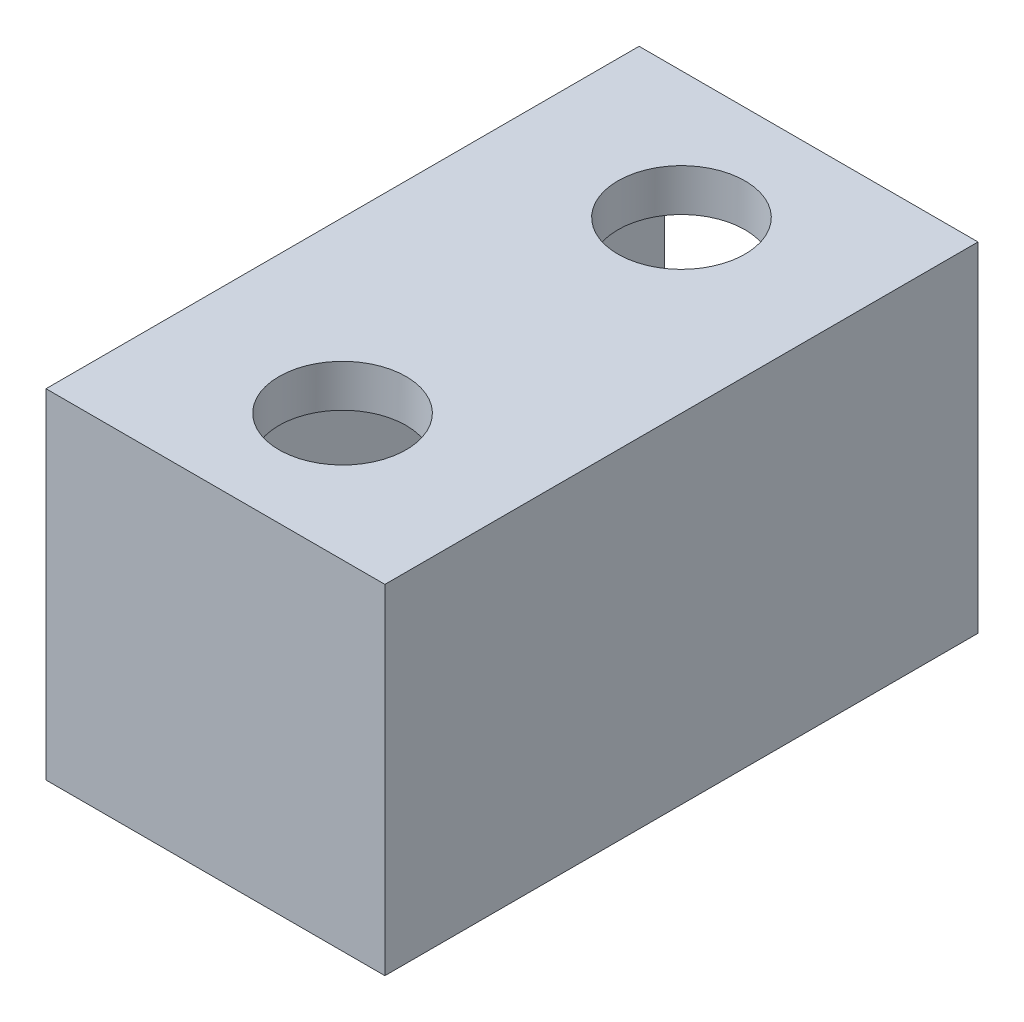
ISO-10303-21;
HEADER;
FILE_DESCRIPTION(('STEP AP214'),'2;1');
FILE_NAME('part.step','',(''),(''),'','','');
FILE_SCHEMA(('AUTOMOTIVE_DESIGN { 1 0 10303 214 1 1 1 1 }'));
ENDSEC;
DATA;
#1=APPLICATION_CONTEXT('core data for automotive mechanical design processes');
#2=APPLICATION_PROTOCOL_DEFINITION('international standard','automotive_design',2000,#1);
#3=PRODUCT_CONTEXT('',#1,'mechanical');
#4=PRODUCT('Part','Part','',(#3));
#5=PRODUCT_RELATED_PRODUCT_CATEGORY('part','',(#4));
#6=PRODUCT_DEFINITION_FORMATION('','',#4);
#7=PRODUCT_DEFINITION_CONTEXT('part definition',#1,'design');
#8=PRODUCT_DEFINITION('design','',#6,#7);
#9=PRODUCT_DEFINITION_SHAPE('','',#8);
#10=(LENGTH_UNIT() NAMED_UNIT(*) SI_UNIT(.MILLI.,.METRE.));
#11=(NAMED_UNIT(*) PLANE_ANGLE_UNIT() SI_UNIT($,.RADIAN.));
#12=(NAMED_UNIT(*) SI_UNIT($,.STERADIAN.) SOLID_ANGLE_UNIT());
#13=UNCERTAINTY_MEASURE_WITH_UNIT(LENGTH_MEASURE(1.E-05),#10,'distance_accuracy_value','');
#14=(GEOMETRIC_REPRESENTATION_CONTEXT(3) GLOBAL_UNCERTAINTY_ASSIGNED_CONTEXT((#13)) GLOBAL_UNIT_ASSIGNED_CONTEXT((#10,
#11,#12)) REPRESENTATION_CONTEXT('',''));
#15=CARTESIAN_POINT('',(0.,0.,0.));
#16=DIRECTION('',(0.,0.,1.));
#17=DIRECTION('',(1.,0.,0.));
#18=AXIS2_PLACEMENT_3D('',#15,#16,#17);
#19=CARTESIAN_POINT('',(-37.,37.,70.));
#20=DIRECTION('',(0.,-1.,0.));
#21=DIRECTION('',(0.,0.,-1.));
#22=AXIS2_PLACEMENT_3D('',#19,#20,#21);
#23=PLANE('',#22);
#24=CARTESIAN_POINT('',(-20.,37.,15.));
#25=DIRECTION('',(0.,-1.,0.));
#26=DIRECTION('',(0.,0.,-1.));
#27=AXIS2_PLACEMENT_3D('',#24,#25,#26);
#28=CIRCLE('',#27,8.5);
#29=CARTESIAN_POINT('',(-20.,37.,6.50000000000001));
#30=VERTEX_POINT('',#29);
#31=EDGE_CURVE('E303',#30,#30,#28,.T.);
#32=ORIENTED_EDGE('',*,*,#31,.F.);
#33=EDGE_LOOP('',(#32));
#34=FACE_BOUND('',#33,.T.);
#35=DIRECTION('',(0.,0.,-1.));
#36=VECTOR('',#35,1.);
#37=CARTESIAN_POINT('',(-3.,37.,70.));
#38=LINE('',#37,#36);
#39=CARTESIAN_POINT('',(-3.,37.,67.));
#40=VERTEX_POINT('',#39);
#41=CARTESIAN_POINT('',(-3.,37.,0.));
#42=VERTEX_POINT('',#41);
#43=EDGE_CURVE('E116',#40,#42,#38,.T.);
#44=ORIENTED_EDGE('',*,*,#43,.F.);
#45=DIRECTION('',(1.,0.,0.));
#46=VECTOR('',#45,1.);
#47=CARTESIAN_POINT('',(-3.,37.,67.));
#48=LINE('',#47,#46);
#49=CARTESIAN_POINT('',(-37.,37.,67.));
#50=VERTEX_POINT('',#49);
#51=EDGE_CURVE('E104',#50,#40,#48,.T.);
#52=ORIENTED_EDGE('',*,*,#51,.F.);
#53=DIRECTION('',(0.,0.,-1.));
#54=VECTOR('',#53,1.);
#55=CARTESIAN_POINT('',(-37.,37.,70.));
#56=LINE('',#55,#54);
#57=CARTESIAN_POINT('',(-37.,37.,0.));
#58=VERTEX_POINT('',#57);
#59=EDGE_CURVE('E63',#50,#58,#56,.T.);
#60=ORIENTED_EDGE('',*,*,#59,.T.);
#61=DIRECTION('',(-1.,0.,0.));
#62=VECTOR('',#61,1.);
#63=CARTESIAN_POINT('',(-37.,37.,0.));
#64=LINE('',#63,#62);
#65=EDGE_CURVE('E121',#42,#58,#64,.T.);
#66=ORIENTED_EDGE('',*,*,#65,.F.);
#67=EDGE_LOOP('',(#44,#52,#60,#66));
#68=FACE_BOUND('',#67,.T.);
#69=CARTESIAN_POINT('',(-20.,37.,55.));
#70=DIRECTION('',(0.,-1.,0.));
#71=DIRECTION('',(0.,0.,-1.));
#72=AXIS2_PLACEMENT_3D('',#69,#70,#71);
#73=CIRCLE('',#72,8.5);
#74=CARTESIAN_POINT('',(-20.,37.,46.5));
#75=VERTEX_POINT('',#74);
#76=EDGE_CURVE('E292',#75,#75,#73,.T.);
#77=ORIENTED_EDGE('',*,*,#76,.F.);
#78=EDGE_LOOP('',(#77));
#79=FACE_BOUND('',#78,.T.);
#80=ADVANCED_FACE('F41',(#34,#68,#79),#23,.T.);
#81=CARTESIAN_POINT('',(-37.,37.,70.));
#82=DIRECTION('',(1.,0.,0.));
#83=DIRECTION('',(0.,1.,0.));
#84=AXIS2_PLACEMENT_3D('',#81,#82,#83);
#85=PLANE('',#84);
#86=ORIENTED_EDGE('',*,*,#59,.F.);
#87=DIRECTION('',(0.,1.,0.));
#88=VECTOR('',#87,1.);
#89=CARTESIAN_POINT('',(-37.,0.,67.));
#90=LINE('',#89,#88);
#91=CARTESIAN_POINT('',(-37.,3.,67.));
#92=VERTEX_POINT('',#91);
#93=EDGE_CURVE('E56',#92,#50,#90,.T.);
#94=ORIENTED_EDGE('',*,*,#93,.F.);
#95=DIRECTION('',(0.,0.,-1.));
#96=VECTOR('',#95,1.);
#97=CARTESIAN_POINT('',(-37.,3.,70.));
#98=LINE('',#97,#96);
#99=CARTESIAN_POINT('',(-37.,3.,0.));
#100=VERTEX_POINT('',#99);
#101=EDGE_CURVE('E124',#92,#100,#98,.T.);
#102=ORIENTED_EDGE('',*,*,#101,.T.);
#103=DIRECTION('',(0.,-1.,0.));
#104=VECTOR('',#103,1.);
#105=CARTESIAN_POINT('',(-37.,37.,0.));
#106=LINE('',#105,#104);
#107=EDGE_CURVE('E315',#58,#100,#106,.T.);
#108=ORIENTED_EDGE('',*,*,#107,.F.);
#109=EDGE_LOOP('',(#86,#94,#102,#108));
#110=FACE_BOUND('',#109,.T.);
#111=ADVANCED_FACE('F193',(#110),#85,.T.);
#112=CARTESIAN_POINT('',(-37.,3.,70.));
#113=DIRECTION('',(0.,1.,0.));
#114=DIRECTION('',(0.,0.,1.));
#115=AXIS2_PLACEMENT_3D('',#112,#113,#114);
#116=PLANE('',#115);
#117=ORIENTED_EDGE('',*,*,#101,.F.);
#118=DIRECTION('',(1.,0.,0.));
#119=VECTOR('',#118,1.);
#120=CARTESIAN_POINT('',(-37.,3.,67.));
#121=LINE('',#120,#119);
#122=CARTESIAN_POINT('',(-3.,3.,67.));
#123=VERTEX_POINT('',#122);
#124=EDGE_CURVE('E313',#92,#123,#121,.T.);
#125=ORIENTED_EDGE('',*,*,#124,.T.);
#126=DIRECTION('',(0.,0.,-1.));
#127=VECTOR('',#126,1.);
#128=CARTESIAN_POINT('',(-3.,3.,70.));
#129=LINE('',#128,#127);
#130=CARTESIAN_POINT('',(-3.,3.,0.));
#131=VERTEX_POINT('',#130);
#132=EDGE_CURVE('E117',#123,#131,#129,.T.);
#133=ORIENTED_EDGE('',*,*,#132,.T.);
#134=DIRECTION('',(1.,0.,0.));
#135=VECTOR('',#134,1.);
#136=CARTESIAN_POINT('',(-37.,3.,0.));
#137=LINE('',#136,#135);
#138=EDGE_CURVE('E318',#100,#131,#137,.T.);
#139=ORIENTED_EDGE('',*,*,#138,.F.);
#140=EDGE_LOOP('',(#117,#125,#133,#139));
#141=FACE_BOUND('',#140,.T.);
#142=ADVANCED_FACE('F199',(#141),#116,.T.);
#143=CARTESIAN_POINT('',(-3.,37.,70.));
#144=DIRECTION('',(-1.,0.,0.));
#145=DIRECTION('',(0.,-1.,0.));
#146=AXIS2_PLACEMENT_3D('',#143,#144,#145);
#147=PLANE('',#146);
#148=ORIENTED_EDGE('',*,*,#132,.F.);
#149=DIRECTION('',(0.,1.,0.));
#150=VECTOR('',#149,1.);
#151=CARTESIAN_POINT('',(-3.,0.,67.));
#152=LINE('',#151,#150);
#153=EDGE_CURVE('E107',#123,#40,#152,.T.);
#154=ORIENTED_EDGE('',*,*,#153,.T.);
#155=ORIENTED_EDGE('',*,*,#43,.T.);
#156=DIRECTION('',(0.,1.,0.));
#157=VECTOR('',#156,1.);
#158=CARTESIAN_POINT('',(-3.,37.,0.));
#159=LINE('',#158,#157);
#160=EDGE_CURVE('E321',#131,#42,#159,.T.);
#161=ORIENTED_EDGE('',*,*,#160,.F.);
#162=EDGE_LOOP('',(#148,#154,#155,#161));
#163=FACE_BOUND('',#162,.T.);
#164=ADVANCED_FACE('F114',(#163),#147,.T.);
#165=CARTESIAN_POINT('',(0.,0.,70.));
#166=DIRECTION('',(0.,0.,1.));
#167=DIRECTION('',(1.,0.,0.));
#168=AXIS2_PLACEMENT_3D('',#165,#166,#167);
#169=PLANE('',#168);
#170=DIRECTION('',(1.,0.,0.));
#171=VECTOR('',#170,1.);
#172=CARTESIAN_POINT('',(0.,0.,70.));
#173=LINE('',#172,#171);
#174=CARTESIAN_POINT('',(-40.,0.,70.));
#175=VERTEX_POINT('',#174);
#176=CARTESIAN_POINT('',(0.,0.,70.));
#177=VERTEX_POINT('',#176);
#178=EDGE_CURVE('E139',#175,#177,#173,.T.);
#179=ORIENTED_EDGE('',*,*,#178,.T.);
#180=DIRECTION('',(0.,1.,0.));
#181=VECTOR('',#180,1.);
#182=CARTESIAN_POINT('',(0.,0.,70.));
#183=LINE('',#182,#181);
#184=CARTESIAN_POINT('',(0.,40.,70.));
#185=VERTEX_POINT('',#184);
#186=EDGE_CURVE('E131',#177,#185,#183,.T.);
#187=ORIENTED_EDGE('',*,*,#186,.T.);
#188=DIRECTION('',(-1.,0.,0.));
#189=VECTOR('',#188,1.);
#190=CARTESIAN_POINT('',(0.,40.,70.));
#191=LINE('',#190,#189);
#192=CARTESIAN_POINT('',(-40.,40.,70.));
#193=VERTEX_POINT('',#192);
#194=EDGE_CURVE('E134',#185,#193,#191,.T.);
#195=ORIENTED_EDGE('',*,*,#194,.T.);
#196=DIRECTION('',(0.,-1.,0.));
#197=VECTOR('',#196,1.);
#198=CARTESIAN_POINT('',(-40.,0.,70.));
#199=LINE('',#198,#197);
#200=EDGE_CURVE('E137',#193,#175,#199,.T.);
#201=ORIENTED_EDGE('',*,*,#200,.T.);
#202=EDGE_LOOP('',(#179,#187,#195,#201));
#203=FACE_BOUND('',#202,.T.);
#204=ADVANCED_FACE('F208',(#203),#169,.T.);
#205=CARTESIAN_POINT('',(0.,0.,0.));
#206=DIRECTION('',(0.,0.,1.));
#207=DIRECTION('',(1.,0.,0.));
#208=AXIS2_PLACEMENT_3D('',#205,#206,#207);
#209=PLANE('',#208);
#210=DIRECTION('',(0.,1.,0.));
#211=VECTOR('',#210,1.);
#212=CARTESIAN_POINT('',(0.,0.,0.));
#213=LINE('',#212,#211);
#214=CARTESIAN_POINT('',(0.,0.,0.));
#215=VERTEX_POINT('',#214);
#216=CARTESIAN_POINT('',(0.,40.,0.));
#217=VERTEX_POINT('',#216);
#218=EDGE_CURVE('E130',#215,#217,#213,.T.);
#219=ORIENTED_EDGE('',*,*,#218,.F.);
#220=DIRECTION('',(1.,0.,0.));
#221=VECTOR('',#220,1.);
#222=CARTESIAN_POINT('',(0.,0.,0.));
#223=LINE('',#222,#221);
#224=CARTESIAN_POINT('',(-40.,0.,0.));
#225=VERTEX_POINT('',#224);
#226=EDGE_CURVE('E135',#225,#215,#223,.T.);
#227=ORIENTED_EDGE('',*,*,#226,.F.);
#228=DIRECTION('',(0.,-1.,0.));
#229=VECTOR('',#228,1.);
#230=CARTESIAN_POINT('',(-40.,0.,0.));
#231=LINE('',#230,#229);
#232=CARTESIAN_POINT('',(-40.,40.,0.));
#233=VERTEX_POINT('',#232);
#234=EDGE_CURVE('E146',#233,#225,#231,.T.);
#235=ORIENTED_EDGE('',*,*,#234,.F.);
#236=DIRECTION('',(-1.,0.,0.));
#237=VECTOR('',#236,1.);
#238=CARTESIAN_POINT('',(0.,40.,0.));
#239=LINE('',#238,#237);
#240=EDGE_CURVE('E144',#217,#233,#239,.T.);
#241=ORIENTED_EDGE('',*,*,#240,.F.);
#242=EDGE_LOOP('',(#219,#227,#235,#241));
#243=FACE_BOUND('',#242,.T.);
#244=ORIENTED_EDGE('',*,*,#107,.T.);
#245=ORIENTED_EDGE('',*,*,#138,.T.);
#246=ORIENTED_EDGE('',*,*,#160,.T.);
#247=ORIENTED_EDGE('',*,*,#65,.T.);
#248=EDGE_LOOP('',(#244,#245,#246,#247));
#249=FACE_BOUND('',#248,.T.);
#250=ADVANCED_FACE('F214',(#243,#249),#209,.F.);
#251=CARTESIAN_POINT('',(0.,0.,70.));
#252=DIRECTION('',(-1.,0.,0.));
#253=DIRECTION('',(0.,0.,1.));
#254=AXIS2_PLACEMENT_3D('',#251,#252,#253);
#255=PLANE('',#254);
#256=ORIENTED_EDGE('',*,*,#218,.T.);
#257=DIRECTION('',(0.,0.,-1.));
#258=VECTOR('',#257,1.);
#259=CARTESIAN_POINT('',(0.,40.,70.));
#260=LINE('',#259,#258);
#261=EDGE_CURVE('E157',#185,#217,#260,.T.);
#262=ORIENTED_EDGE('',*,*,#261,.F.);
#263=ORIENTED_EDGE('',*,*,#186,.F.);
#264=DIRECTION('',(0.,0.,-1.));
#265=VECTOR('',#264,1.);
#266=CARTESIAN_POINT('',(0.,0.,70.));
#267=LINE('',#266,#265);
#268=EDGE_CURVE('E141',#177,#215,#267,.T.);
#269=ORIENTED_EDGE('',*,*,#268,.T.);
#270=EDGE_LOOP('',(#256,#262,#263,#269));
#271=FACE_BOUND('',#270,.T.);
#272=ADVANCED_FACE('F218',(#271),#255,.F.);
#273=CARTESIAN_POINT('',(0.,40.,70.));
#274=DIRECTION('',(0.,-1.,0.));
#275=DIRECTION('',(1.,0.,0.));
#276=AXIS2_PLACEMENT_3D('',#273,#274,#275);
#277=PLANE('',#276);
#278=CARTESIAN_POINT('',(-20.,40.,15.));
#279=DIRECTION('',(0.,1.,0.));
#280=DIRECTION('',(-1.,0.,0.));
#281=AXIS2_PLACEMENT_3D('',#278,#279,#280);
#282=CIRCLE('',#281,7.5);
#283=CARTESIAN_POINT('',(-27.5,40.,15.));
#284=VERTEX_POINT('',#283);
#285=EDGE_CURVE('E110',#284,#284,#282,.T.);
#286=ORIENTED_EDGE('',*,*,#285,.F.);
#287=EDGE_LOOP('',(#286));
#288=FACE_BOUND('',#287,.T.);
#289=CARTESIAN_POINT('',(-20.,40.,55.));
#290=DIRECTION('',(0.,1.,0.));
#291=DIRECTION('',(-1.,0.,0.));
#292=AXIS2_PLACEMENT_3D('',#289,#290,#291);
#293=CIRCLE('',#292,7.5);
#294=CARTESIAN_POINT('',(-27.5,40.,55.));
#295=VERTEX_POINT('',#294);
#296=EDGE_CURVE('E287',#295,#295,#293,.T.);
#297=ORIENTED_EDGE('',*,*,#296,.F.);
#298=EDGE_LOOP('',(#297));
#299=FACE_BOUND('',#298,.T.);
#300=ORIENTED_EDGE('',*,*,#240,.T.);
#301=DIRECTION('',(0.,0.,-1.));
#302=VECTOR('',#301,1.);
#303=CARTESIAN_POINT('',(-40.,40.,70.));
#304=LINE('',#303,#302);
#305=EDGE_CURVE('E154',#193,#233,#304,.T.);
#306=ORIENTED_EDGE('',*,*,#305,.F.);
#307=ORIENTED_EDGE('',*,*,#194,.F.);
#308=ORIENTED_EDGE('',*,*,#261,.T.);
#309=EDGE_LOOP('',(#300,#306,#307,#308));
#310=FACE_BOUND('',#309,.T.);
#311=ADVANCED_FACE('F225',(#288,#299,#310),#277,.F.);
#312=CARTESIAN_POINT('',(-40.,0.,70.));
#313=DIRECTION('',(1.,0.,0.));
#314=DIRECTION('',(0.,0.,-1.));
#315=AXIS2_PLACEMENT_3D('',#312,#313,#314);
#316=PLANE('',#315);
#317=ORIENTED_EDGE('',*,*,#234,.T.);
#318=DIRECTION('',(0.,0.,-1.));
#319=VECTOR('',#318,1.);
#320=CARTESIAN_POINT('',(-40.,0.,70.));
#321=LINE('',#320,#319);
#322=EDGE_CURVE('E151',#175,#225,#321,.T.);
#323=ORIENTED_EDGE('',*,*,#322,.F.);
#324=ORIENTED_EDGE('',*,*,#200,.F.);
#325=ORIENTED_EDGE('',*,*,#305,.T.);
#326=EDGE_LOOP('',(#317,#323,#324,#325));
#327=FACE_BOUND('',#326,.T.);
#328=ADVANCED_FACE('F222',(#327),#316,.F.);
#329=CARTESIAN_POINT('',(0.,0.,70.));
#330=DIRECTION('',(0.,1.,0.));
#331=DIRECTION('',(-1.,0.,0.));
#332=AXIS2_PLACEMENT_3D('',#329,#330,#331);
#333=PLANE('',#332);
#334=CARTESIAN_POINT('',(-20.,0.,55.));
#335=DIRECTION('',(0.,1.,0.));
#336=DIRECTION('',(-1.,0.,0.));
#337=AXIS2_PLACEMENT_3D('',#334,#335,#336);
#338=CIRCLE('',#337,9.);
#339=CARTESIAN_POINT('',(-29.,0.,55.));
#340=VERTEX_POINT('',#339);
#341=EDGE_CURVE('E49',#340,#340,#338,.T.);
#342=ORIENTED_EDGE('',*,*,#341,.T.);
#343=EDGE_LOOP('',(#342));
#344=FACE_BOUND('',#343,.T.);
#345=CARTESIAN_POINT('',(-20.,0.,15.));
#346=DIRECTION('',(0.,1.,0.));
#347=DIRECTION('',(-1.,0.,0.));
#348=AXIS2_PLACEMENT_3D('',#345,#346,#347);
#349=CIRCLE('',#348,9.);
#350=CARTESIAN_POINT('',(-29.,0.,15.));
#351=VERTEX_POINT('',#350);
#352=EDGE_CURVE('E172',#351,#351,#349,.T.);
#353=ORIENTED_EDGE('',*,*,#352,.T.);
#354=EDGE_LOOP('',(#353));
#355=FACE_BOUND('',#354,.T.);
#356=ORIENTED_EDGE('',*,*,#268,.F.);
#357=ORIENTED_EDGE('',*,*,#178,.F.);
#358=ORIENTED_EDGE('',*,*,#322,.T.);
#359=ORIENTED_EDGE('',*,*,#226,.T.);
#360=EDGE_LOOP('',(#356,#357,#358,#359));
#361=FACE_BOUND('',#360,.T.);
#362=ADVANCED_FACE('F180',(#344,#355,#361),#333,.F.);
#363=CARTESIAN_POINT('',(-3.,0.,67.));
#364=DIRECTION('',(0.,0.,1.));
#365=DIRECTION('',(1.,0.,0.));
#366=AXIS2_PLACEMENT_3D('',#363,#364,#365);
#367=PLANE('',#366);
#368=ORIENTED_EDGE('',*,*,#124,.F.);
#369=ORIENTED_EDGE('',*,*,#93,.T.);
#370=ORIENTED_EDGE('',*,*,#51,.T.);
#371=ORIENTED_EDGE('',*,*,#153,.F.);
#372=EDGE_LOOP('',(#368,#369,#370,#371));
#373=FACE_BOUND('',#372,.T.);
#374=ADVANCED_FACE('F106',(#373),#367,.F.);
#375=CARTESIAN_POINT('',(-20.,3.,55.));
#376=DIRECTION('',(0.,1.,0.));
#377=DIRECTION('',(-1.,0.,0.));
#378=AXIS2_PLACEMENT_3D('',#375,#376,#377);
#379=CYLINDRICAL_SURFACE('',#378,7.5);
#380=ORIENTED_EDGE('',*,*,#296,.T.);
#381=EDGE_LOOP('',(#380));
#382=FACE_BOUND('',#381,.T.);
#383=CARTESIAN_POINT('',(-20.,35.,55.));
#384=DIRECTION('',(0.,-1.,0.));
#385=DIRECTION('',(0.,0.,-1.));
#386=AXIS2_PLACEMENT_3D('',#383,#384,#385);
#387=CIRCLE('',#386,7.5);
#388=CARTESIAN_POINT('',(-20.,35.,47.5));
#389=VERTEX_POINT('',#388);
#390=EDGE_CURVE('E290',#389,#389,#387,.T.);
#391=ORIENTED_EDGE('',*,*,#390,.T.);
#392=EDGE_LOOP('',(#391));
#393=FACE_BOUND('',#392,.T.);
#394=ADVANCED_FACE('F277',(#382,#393),#379,.F.);
#395=CARTESIAN_POINT('',(-20.,3.,15.));
#396=DIRECTION('',(0.,1.,0.));
#397=DIRECTION('',(-1.,0.,0.));
#398=AXIS2_PLACEMENT_3D('',#395,#396,#397);
#399=CYLINDRICAL_SURFACE('',#398,7.5);
#400=ORIENTED_EDGE('',*,*,#285,.T.);
#401=EDGE_LOOP('',(#400));
#402=FACE_BOUND('',#401,.T.);
#403=CARTESIAN_POINT('',(-20.,35.,15.));
#404=DIRECTION('',(0.,-1.,0.));
#405=DIRECTION('',(0.,0.,-1.));
#406=AXIS2_PLACEMENT_3D('',#403,#404,#405);
#407=CIRCLE('',#406,7.5);
#408=CARTESIAN_POINT('',(-20.,35.,7.50000000000001));
#409=VERTEX_POINT('',#408);
#410=EDGE_CURVE('E299',#409,#409,#407,.T.);
#411=ORIENTED_EDGE('',*,*,#410,.T.);
#412=EDGE_LOOP('',(#411));
#413=FACE_BOUND('',#412,.T.);
#414=ADVANCED_FACE('F271',(#402,#413),#399,.F.);
#415=CARTESIAN_POINT('',(-20.,35.,15.));
#416=DIRECTION('',(0.,-1.,0.));
#417=DIRECTION('',(0.,0.,-1.));
#418=AXIS2_PLACEMENT_3D('',#415,#416,#417);
#419=PLANE('',#418);
#420=CARTESIAN_POINT('',(-20.,35.,15.));
#421=DIRECTION('',(0.,-1.,0.));
#422=DIRECTION('',(0.,0.,-1.));
#423=AXIS2_PLACEMENT_3D('',#420,#421,#422);
#424=CIRCLE('',#423,8.5);
#425=CARTESIAN_POINT('',(-20.,35.,6.50000000000001));
#426=VERTEX_POINT('',#425);
#427=EDGE_CURVE('E304',#426,#426,#424,.T.);
#428=ORIENTED_EDGE('',*,*,#427,.T.);
#429=EDGE_LOOP('',(#428));
#430=FACE_BOUND('',#429,.T.);
#431=ORIENTED_EDGE('',*,*,#410,.F.);
#432=EDGE_LOOP('',(#431));
#433=FACE_BOUND('',#432,.T.);
#434=ADVANCED_FACE('F268',(#430,#433),#419,.T.);
#435=CARTESIAN_POINT('',(-20.,35.,15.));
#436=DIRECTION('',(0.,1.,0.));
#437=DIRECTION('',(0.,0.,1.));
#438=AXIS2_PLACEMENT_3D('',#435,#436,#437);
#439=CYLINDRICAL_SURFACE('',#438,8.5);
#440=ORIENTED_EDGE('',*,*,#427,.F.);
#441=EDGE_LOOP('',(#440));
#442=FACE_BOUND('',#441,.T.);
#443=ORIENTED_EDGE('',*,*,#31,.T.);
#444=EDGE_LOOP('',(#443));
#445=FACE_BOUND('',#444,.T.);
#446=ADVANCED_FACE('F265',(#442,#445),#439,.T.);
#447=CARTESIAN_POINT('',(-20.,35.,55.));
#448=DIRECTION('',(0.,-1.,0.));
#449=DIRECTION('',(0.,0.,-1.));
#450=AXIS2_PLACEMENT_3D('',#447,#448,#449);
#451=PLANE('',#450);
#452=CARTESIAN_POINT('',(-20.,35.,55.));
#453=DIRECTION('',(0.,-1.,0.));
#454=DIRECTION('',(0.,0.,-1.));
#455=AXIS2_PLACEMENT_3D('',#452,#453,#454);
#456=CIRCLE('',#455,8.5);
#457=CARTESIAN_POINT('',(-20.,35.,46.5));
#458=VERTEX_POINT('',#457);
#459=EDGE_CURVE('E295',#458,#458,#456,.T.);
#460=ORIENTED_EDGE('',*,*,#459,.T.);
#461=EDGE_LOOP('',(#460));
#462=FACE_BOUND('',#461,.T.);
#463=ORIENTED_EDGE('',*,*,#390,.F.);
#464=EDGE_LOOP('',(#463));
#465=FACE_BOUND('',#464,.T.);
#466=ADVANCED_FACE('F259',(#462,#465),#451,.T.);
#467=CARTESIAN_POINT('',(-20.,35.,55.));
#468=DIRECTION('',(0.,1.,0.));
#469=DIRECTION('',(0.,0.,1.));
#470=AXIS2_PLACEMENT_3D('',#467,#468,#469);
#471=CYLINDRICAL_SURFACE('',#470,8.5);
#472=ORIENTED_EDGE('',*,*,#459,.F.);
#473=EDGE_LOOP('',(#472));
#474=FACE_BOUND('',#473,.T.);
#475=ORIENTED_EDGE('',*,*,#76,.T.);
#476=EDGE_LOOP('',(#475));
#477=FACE_BOUND('',#476,.T.);
#478=ADVANCED_FACE('F249',(#474,#477),#471,.T.);
#479=CARTESIAN_POINT('',(-20.,-7.,15.));
#480=DIRECTION('',(0.,1.,0.));
#481=DIRECTION('',(0.,0.,1.));
#482=AXIS2_PLACEMENT_3D('',#479,#480,#481);
#483=CYLINDRICAL_SURFACE('',#482,7.5);
#484=CARTESIAN_POINT('',(-20.,-1.5,15.));
#485=DIRECTION('',(0.,1.,0.));
#486=DIRECTION('',(-1.,0.,0.));
#487=AXIS2_PLACEMENT_3D('',#484,#485,#486);
#488=CIRCLE('',#487,7.5);
#489=CARTESIAN_POINT('',(-27.5,-1.5,15.));
#490=VERTEX_POINT('',#489);
#491=EDGE_CURVE('E175',#490,#490,#488,.F.);
#492=ORIENTED_EDGE('',*,*,#491,.T.);
#493=EDGE_LOOP('',(#492));
#494=FACE_BOUND('',#493,.T.);
#495=CARTESIAN_POINT('',(-20.,-5.50000000000001,15.));
#496=DIRECTION('',(0.,1.,0.));
#497=DIRECTION('',(0.,0.,1.));
#498=AXIS2_PLACEMENT_3D('',#495,#496,#497);
#499=CIRCLE('',#498,7.5);
#500=CARTESIAN_POINT('',(-20.,-5.50000000000001,22.5));
#501=VERTEX_POINT('',#500);
#502=EDGE_CURVE('E166',#501,#501,#499,.T.);
#503=ORIENTED_EDGE('',*,*,#502,.T.);
#504=EDGE_LOOP('',(#503));
#505=FACE_BOUND('',#504,.T.);
#506=ADVANCED_FACE('F246',(#494,#505),#483,.T.);
#507=CARTESIAN_POINT('',(-20.,-7.,15.));
#508=DIRECTION('',(0.,1.,0.));
#509=DIRECTION('',(0.,0.,1.));
#510=AXIS2_PLACEMENT_3D('',#507,#508,#509);
#511=PLANE('',#510);
#512=CARTESIAN_POINT('',(-20.,-7.,15.));
#513=DIRECTION('',(0.,1.,0.));
#514=DIRECTION('',(0.,0.,1.));
#515=AXIS2_PLACEMENT_3D('',#512,#513,#514);
#516=CIRCLE('',#515,6.);
#517=CARTESIAN_POINT('',(-20.,-7.,21.));
#518=VERTEX_POINT('',#517);
#519=EDGE_CURVE('E169',#518,#518,#516,.F.);
#520=ORIENTED_EDGE('',*,*,#519,.T.);
#521=EDGE_LOOP('',(#520));
#522=FACE_BOUND('',#521,.T.);
#523=ADVANCED_FACE('F248',(#522),#511,.F.);
#524=CARTESIAN_POINT('',(-20.,-7.,55.));
#525=DIRECTION('',(0.,1.,0.));
#526=DIRECTION('',(0.,0.,1.));
#527=AXIS2_PLACEMENT_3D('',#524,#525,#526);
#528=CYLINDRICAL_SURFACE('',#527,7.5);
#529=CARTESIAN_POINT('',(-20.,-1.5,55.));
#530=DIRECTION('',(0.,1.,0.));
#531=DIRECTION('',(-1.,0.,0.));
#532=AXIS2_PLACEMENT_3D('',#529,#530,#531);
#533=CIRCLE('',#532,7.5);
#534=CARTESIAN_POINT('',(-27.5,-1.5,55.));
#535=VERTEX_POINT('',#534);
#536=EDGE_CURVE('E11',#535,#535,#533,.F.);
#537=ORIENTED_EDGE('',*,*,#536,.T.);
#538=EDGE_LOOP('',(#537));
#539=FACE_BOUND('',#538,.T.);
#540=CARTESIAN_POINT('',(-20.,-5.50000000000001,55.));
#541=DIRECTION('',(0.,1.,0.));
#542=DIRECTION('',(0.,0.,1.));
#543=AXIS2_PLACEMENT_3D('',#540,#541,#542);
#544=CIRCLE('',#543,7.5);
#545=CARTESIAN_POINT('',(-20.,-5.50000000000001,62.5));
#546=VERTEX_POINT('',#545);
#547=EDGE_CURVE('E160',#546,#546,#544,.T.);
#548=ORIENTED_EDGE('',*,*,#547,.T.);
#549=EDGE_LOOP('',(#548));
#550=FACE_BOUND('',#549,.T.);
#551=ADVANCED_FACE('F256',(#539,#550),#528,.T.);
#552=CARTESIAN_POINT('',(-20.,-7.,55.));
#553=DIRECTION('',(0.,1.,0.));
#554=DIRECTION('',(0.,0.,1.));
#555=AXIS2_PLACEMENT_3D('',#552,#553,#554);
#556=PLANE('',#555);
#557=CARTESIAN_POINT('',(-20.,-7.,55.));
#558=DIRECTION('',(0.,1.,0.));
#559=DIRECTION('',(0.,0.,1.));
#560=AXIS2_PLACEMENT_3D('',#557,#558,#559);
#561=CIRCLE('',#560,6.);
#562=CARTESIAN_POINT('',(-20.,-7.,61.));
#563=VERTEX_POINT('',#562);
#564=EDGE_CURVE('E163',#563,#563,#561,.F.);
#565=ORIENTED_EDGE('',*,*,#564,.T.);
#566=EDGE_LOOP('',(#565));
#567=FACE_BOUND('',#566,.T.);
#568=ADVANCED_FACE('F236',(#567),#556,.F.);
#569=CARTESIAN_POINT('',(-20.,-5.50000000000001,55.));
#570=DIRECTION('',(0.,1.,0.));
#571=DIRECTION('',(0.,0.,1.));
#572=AXIS2_PLACEMENT_3D('',#569,#570,#571);
#573=TOROIDAL_SURFACE('',#572,6.,1.5);
#574=ORIENTED_EDGE('',*,*,#564,.F.);
#575=EDGE_LOOP('',(#574));
#576=FACE_BOUND('',#575,.T.);
#577=ORIENTED_EDGE('',*,*,#547,.F.);
#578=EDGE_LOOP('',(#577));
#579=FACE_BOUND('',#578,.T.);
#580=ADVANCED_FACE('F233',(#576,#579),#573,.T.);
#581=CARTESIAN_POINT('',(-20.,-5.50000000000001,15.));
#582=DIRECTION('',(0.,1.,0.));
#583=DIRECTION('',(0.,0.,1.));
#584=AXIS2_PLACEMENT_3D('',#581,#582,#583);
#585=TOROIDAL_SURFACE('',#584,6.,1.5);
#586=ORIENTED_EDGE('',*,*,#519,.F.);
#587=EDGE_LOOP('',(#586));
#588=FACE_BOUND('',#587,.T.);
#589=ORIENTED_EDGE('',*,*,#502,.F.);
#590=EDGE_LOOP('',(#589));
#591=FACE_BOUND('',#590,.T.);
#592=ADVANCED_FACE('F189',(#588,#591),#585,.T.);
#593=CARTESIAN_POINT('',(-20.,-1.5,15.));
#594=DIRECTION('',(0.,1.,0.));
#595=DIRECTION('',(-1.,0.,0.));
#596=AXIS2_PLACEMENT_3D('',#593,#594,#595);
#597=TOROIDAL_SURFACE('',#596,9.,1.5);
#598=ORIENTED_EDGE('',*,*,#491,.F.);
#599=EDGE_LOOP('',(#598));
#600=FACE_BOUND('',#599,.T.);
#601=ORIENTED_EDGE('',*,*,#352,.F.);
#602=EDGE_LOOP('',(#601));
#603=FACE_BOUND('',#602,.T.);
#604=ADVANCED_FACE('F184',(#600,#603),#597,.F.);
#605=CARTESIAN_POINT('',(-20.,-1.5,55.));
#606=DIRECTION('',(0.,1.,0.));
#607=DIRECTION('',(-1.,0.,0.));
#608=AXIS2_PLACEMENT_3D('',#605,#606,#607);
#609=TOROIDAL_SURFACE('',#608,9.,1.5);
#610=ORIENTED_EDGE('',*,*,#536,.F.);
#611=EDGE_LOOP('',(#610));
#612=FACE_BOUND('',#611,.T.);
#613=ORIENTED_EDGE('',*,*,#341,.F.);
#614=EDGE_LOOP('',(#613));
#615=FACE_BOUND('',#614,.T.);
#616=ADVANCED_FACE('F43',(#612,#615),#609,.F.);
#617=CLOSED_SHELL('',(#80,#111,#142,#164,#204,#250,#272,#311,#328,#362,#374,#394,#414,#434,#446,
#466,#478,#506,#523,#551,#568,#580,#592,#604,#616));
#618=MANIFOLD_SOLID_BREP('B2',#617);
#619=ADVANCED_BREP_SHAPE_REPRESENTATION('',(#18,#618),#14);
#620=SHAPE_DEFINITION_REPRESENTATION(#9,#619);
ENDSEC;
END-ISO-10303-21;
